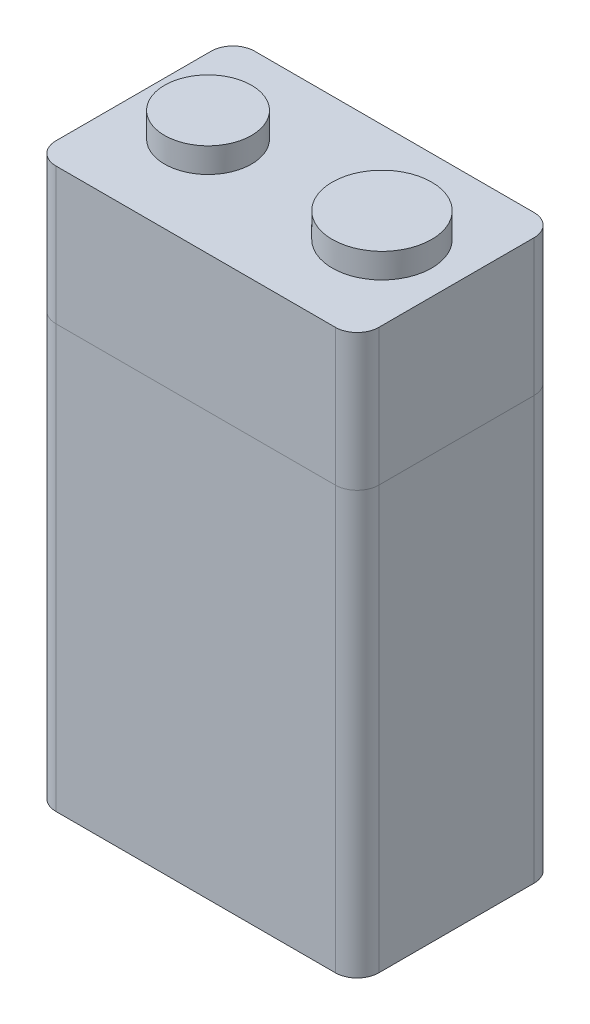
ISO-10303-21;
HEADER;
FILE_DESCRIPTION(('STEP AP214'),'2;1');
FILE_NAME('part.step','',(''),(''),'','','');
FILE_SCHEMA(('AUTOMOTIVE_DESIGN { 1 0 10303 214 1 1 1 1 }'));
ENDSEC;
DATA;
#1=APPLICATION_CONTEXT('core data for automotive mechanical design processes');
#2=APPLICATION_PROTOCOL_DEFINITION('international standard','automotive_design',2000,#1);
#3=PRODUCT_CONTEXT('',#1,'mechanical');
#4=PRODUCT('Part','Part','',(#3));
#5=PRODUCT_RELATED_PRODUCT_CATEGORY('part','',(#4));
#6=PRODUCT_DEFINITION_FORMATION('','',#4);
#7=PRODUCT_DEFINITION_CONTEXT('part definition',#1,'design');
#8=PRODUCT_DEFINITION('design','',#6,#7);
#9=PRODUCT_DEFINITION_SHAPE('','',#8);
#10=(LENGTH_UNIT() NAMED_UNIT(*) SI_UNIT(.MILLI.,.METRE.));
#11=(NAMED_UNIT(*) PLANE_ANGLE_UNIT() SI_UNIT($,.RADIAN.));
#12=(NAMED_UNIT(*) SI_UNIT($,.STERADIAN.) SOLID_ANGLE_UNIT());
#13=UNCERTAINTY_MEASURE_WITH_UNIT(LENGTH_MEASURE(1.E-05),#10,'distance_accuracy_value','');
#14=(GEOMETRIC_REPRESENTATION_CONTEXT(3) GLOBAL_UNCERTAINTY_ASSIGNED_CONTEXT((#13)) GLOBAL_UNIT_ASSIGNED_CONTEXT((#10,
#11,#12)) REPRESENTATION_CONTEXT('',''));
#15=CARTESIAN_POINT('',(0.,0.,0.));
#16=DIRECTION('',(0.,0.,1.));
#17=DIRECTION('',(1.,0.,0.));
#18=AXIS2_PLACEMENT_3D('',#15,#16,#17);
#19=CARTESIAN_POINT('',(-11.25,45.,6.25));
#20=DIRECTION('',(0.,-1.,0.));
#21=DIRECTION('',(0.,0.,-1.));
#22=AXIS2_PLACEMENT_3D('',#19,#20,#21);
#23=CYLINDRICAL_SURFACE('',#22,1.75);
#24=DIRECTION('',(0.,-1.,0.));
#25=VECTOR('',#24,1.);
#26=CARTESIAN_POINT('',(-11.25,45.,8.));
#27=LINE('',#26,#25);
#28=CARTESIAN_POINT('',(-11.25,34.,8.));
#29=VERTEX_POINT('',#28);
#30=CARTESIAN_POINT('',(-11.25,0.,8.));
#31=VERTEX_POINT('',#30);
#32=EDGE_CURVE('E206',#29,#31,#27,.T.);
#33=ORIENTED_EDGE('',*,*,#32,.F.);
#34=CARTESIAN_POINT('',(-11.25,34.,6.25));
#35=DIRECTION('',(0.,1.,0.));
#36=DIRECTION('',(0.,0.,1.));
#37=AXIS2_PLACEMENT_3D('',#34,#35,#36);
#38=CIRCLE('',#37,1.75);
#39=CARTESIAN_POINT('',(-13.,34.,6.25));
#40=VERTEX_POINT('',#39);
#41=EDGE_CURVE('E11',#29,#40,#38,.F.);
#42=ORIENTED_EDGE('',*,*,#41,.T.);
#43=DIRECTION('',(0.,-1.,0.));
#44=VECTOR('',#43,1.);
#45=CARTESIAN_POINT('',(-13.,45.,6.25));
#46=LINE('',#45,#44);
#47=CARTESIAN_POINT('',(-13.,0.,6.25));
#48=VERTEX_POINT('',#47);
#49=EDGE_CURVE('E215',#48,#40,#46,.F.);
#50=ORIENTED_EDGE('',*,*,#49,.F.);
#51=CARTESIAN_POINT('',(-11.25,0.,6.25));
#52=DIRECTION('',(0.,-1.,0.));
#53=DIRECTION('',(0.,0.,-1.));
#54=AXIS2_PLACEMENT_3D('',#51,#52,#53);
#55=CIRCLE('',#54,1.75);
#56=EDGE_CURVE('E189',#31,#48,#55,.T.);
#57=ORIENTED_EDGE('',*,*,#56,.F.);
#58=EDGE_LOOP('',(#33,#42,#50,#57));
#59=FACE_BOUND('',#58,.T.);
#60=ADVANCED_FACE('F47',(#59),#23,.T.);
#61=CARTESIAN_POINT('',(-13.,45.,8.));
#62=DIRECTION('',(1.,0.,0.));
#63=DIRECTION('',(0.,0.,-1.));
#64=AXIS2_PLACEMENT_3D('',#61,#62,#63);
#65=PLANE('',#64);
#66=DIRECTION('',(0.,0.,1.));
#67=VECTOR('',#66,1.);
#68=CARTESIAN_POINT('',(-13.,34.,8.));
#69=LINE('',#68,#67);
#70=CARTESIAN_POINT('',(-13.,34.,-6.25));
#71=VERTEX_POINT('',#70);
#72=EDGE_CURVE('E57',#71,#40,#69,.T.);
#73=ORIENTED_EDGE('',*,*,#72,.F.);
#74=DIRECTION('',(0.,-1.,0.));
#75=VECTOR('',#74,1.);
#76=CARTESIAN_POINT('',(-13.,45.,-6.25));
#77=LINE('',#76,#75);
#78=CARTESIAN_POINT('',(-13.,0.,-6.25));
#79=VERTEX_POINT('',#78);
#80=EDGE_CURVE('E217',#71,#79,#77,.T.);
#81=ORIENTED_EDGE('',*,*,#80,.T.);
#82=DIRECTION('',(0.,0.,1.));
#83=VECTOR('',#82,1.);
#84=CARTESIAN_POINT('',(-13.,0.,8.));
#85=LINE('',#84,#83);
#86=EDGE_CURVE('E167',#79,#48,#85,.T.);
#87=ORIENTED_EDGE('',*,*,#86,.T.);
#88=ORIENTED_EDGE('',*,*,#49,.T.);
#89=EDGE_LOOP('',(#73,#81,#87,#88));
#90=FACE_BOUND('',#89,.T.);
#91=ADVANCED_FACE('F293',(#90),#65,.F.);
#92=CARTESIAN_POINT('',(-11.25,45.,-6.25));
#93=DIRECTION('',(0.,-1.,0.));
#94=DIRECTION('',(0.,0.,-1.));
#95=AXIS2_PLACEMENT_3D('',#92,#93,#94);
#96=CYLINDRICAL_SURFACE('',#95,1.75);
#97=ORIENTED_EDGE('',*,*,#80,.F.);
#98=CARTESIAN_POINT('',(-11.25,34.,-6.25));
#99=DIRECTION('',(0.,1.,0.));
#100=DIRECTION('',(0.,0.,1.));
#101=AXIS2_PLACEMENT_3D('',#98,#99,#100);
#102=CIRCLE('',#101,1.75);
#103=CARTESIAN_POINT('',(-11.25,34.,-8.));
#104=VERTEX_POINT('',#103);
#105=EDGE_CURVE('E229',#71,#104,#102,.F.);
#106=ORIENTED_EDGE('',*,*,#105,.T.);
#107=DIRECTION('',(0.,-1.,0.));
#108=VECTOR('',#107,1.);
#109=CARTESIAN_POINT('',(-11.25,45.,-8.));
#110=LINE('',#109,#108);
#111=CARTESIAN_POINT('',(-11.25,0.,-8.));
#112=VERTEX_POINT('',#111);
#113=EDGE_CURVE('E150',#112,#104,#110,.F.);
#114=ORIENTED_EDGE('',*,*,#113,.F.);
#115=CARTESIAN_POINT('',(-11.25,0.,-6.25));
#116=DIRECTION('',(0.,-1.,0.));
#117=DIRECTION('',(0.,0.,-1.));
#118=AXIS2_PLACEMENT_3D('',#115,#116,#117);
#119=CIRCLE('',#118,1.75);
#120=EDGE_CURVE('E166',#79,#112,#119,.T.);
#121=ORIENTED_EDGE('',*,*,#120,.F.);
#122=EDGE_LOOP('',(#97,#106,#114,#121));
#123=FACE_BOUND('',#122,.T.);
#124=ADVANCED_FACE('F299',(#123),#96,.T.);
#125=CARTESIAN_POINT('',(-13.,45.,-8.));
#126=DIRECTION('',(0.,0.,1.));
#127=DIRECTION('',(1.,0.,0.));
#128=AXIS2_PLACEMENT_3D('',#125,#126,#127);
#129=PLANE('',#128);
#130=DIRECTION('',(-1.,0.,0.));
#131=VECTOR('',#130,1.);
#132=CARTESIAN_POINT('',(-13.,34.,-8.));
#133=LINE('',#132,#131);
#134=CARTESIAN_POINT('',(11.25,34.,-8.));
#135=VERTEX_POINT('',#134);
#136=EDGE_CURVE('E145',#135,#104,#133,.T.);
#137=ORIENTED_EDGE('',*,*,#136,.F.);
#138=DIRECTION('',(0.,-1.,0.));
#139=VECTOR('',#138,1.);
#140=CARTESIAN_POINT('',(11.25,45.,-8.));
#141=LINE('',#140,#139);
#142=CARTESIAN_POINT('',(11.25,0.,-8.));
#143=VERTEX_POINT('',#142);
#144=EDGE_CURVE('E137',#135,#143,#141,.T.);
#145=ORIENTED_EDGE('',*,*,#144,.T.);
#146=DIRECTION('',(-1.,0.,0.));
#147=VECTOR('',#146,1.);
#148=CARTESIAN_POINT('',(-13.,0.,-8.));
#149=LINE('',#148,#147);
#150=EDGE_CURVE('E142',#143,#112,#149,.T.);
#151=ORIENTED_EDGE('',*,*,#150,.T.);
#152=ORIENTED_EDGE('',*,*,#113,.T.);
#153=EDGE_LOOP('',(#137,#145,#151,#152));
#154=FACE_BOUND('',#153,.T.);
#155=ADVANCED_FACE('F139',(#154),#129,.F.);
#156=CARTESIAN_POINT('',(11.25,45.,-6.25));
#157=DIRECTION('',(0.,-1.,0.));
#158=DIRECTION('',(0.,0.,-1.));
#159=AXIS2_PLACEMENT_3D('',#156,#157,#158);
#160=CYLINDRICAL_SURFACE('',#159,1.75);
#161=ORIENTED_EDGE('',*,*,#144,.F.);
#162=CARTESIAN_POINT('',(11.25,34.,-6.25));
#163=DIRECTION('',(0.,1.,0.));
#164=DIRECTION('',(0.,0.,1.));
#165=AXIS2_PLACEMENT_3D('',#162,#163,#164);
#166=CIRCLE('',#165,1.75);
#167=CARTESIAN_POINT('',(13.,34.,-6.25));
#168=VERTEX_POINT('',#167);
#169=EDGE_CURVE('E225',#135,#168,#166,.F.);
#170=ORIENTED_EDGE('',*,*,#169,.T.);
#171=DIRECTION('',(0.,-1.,0.));
#172=VECTOR('',#171,1.);
#173=CARTESIAN_POINT('',(13.,45.,-6.25));
#174=LINE('',#173,#172);
#175=CARTESIAN_POINT('',(13.,0.,-6.25));
#176=VERTEX_POINT('',#175);
#177=EDGE_CURVE('E156',#176,#168,#174,.F.);
#178=ORIENTED_EDGE('',*,*,#177,.F.);
#179=CARTESIAN_POINT('',(11.25,0.,-6.25));
#180=DIRECTION('',(0.,-1.,0.));
#181=DIRECTION('',(0.,0.,-1.));
#182=AXIS2_PLACEMENT_3D('',#179,#180,#181);
#183=CIRCLE('',#182,1.75);
#184=EDGE_CURVE('E153',#143,#176,#183,.T.);
#185=ORIENTED_EDGE('',*,*,#184,.F.);
#186=EDGE_LOOP('',(#161,#170,#178,#185));
#187=FACE_BOUND('',#186,.T.);
#188=ADVANCED_FACE('F154',(#187),#160,.T.);
#189=CARTESIAN_POINT('',(13.,45.,8.));
#190=DIRECTION('',(-1.,0.,0.));
#191=DIRECTION('',(0.,0.,1.));
#192=AXIS2_PLACEMENT_3D('',#189,#190,#191);
#193=PLANE('',#192);
#194=DIRECTION('',(0.,0.,-1.));
#195=VECTOR('',#194,1.);
#196=CARTESIAN_POINT('',(13.,34.,8.));
#197=LINE('',#196,#195);
#198=CARTESIAN_POINT('',(13.,34.,6.25));
#199=VERTEX_POINT('',#198);
#200=EDGE_CURVE('E221',#199,#168,#197,.T.);
#201=ORIENTED_EDGE('',*,*,#200,.F.);
#202=DIRECTION('',(0.,-1.,0.));
#203=VECTOR('',#202,1.);
#204=CARTESIAN_POINT('',(13.,45.,6.25));
#205=LINE('',#204,#203);
#206=CARTESIAN_POINT('',(13.,0.,6.25));
#207=VERTEX_POINT('',#206);
#208=EDGE_CURVE('E160',#199,#207,#205,.T.);
#209=ORIENTED_EDGE('',*,*,#208,.T.);
#210=DIRECTION('',(0.,0.,-1.));
#211=VECTOR('',#210,1.);
#212=CARTESIAN_POINT('',(13.,0.,8.));
#213=LINE('',#212,#211);
#214=EDGE_CURVE('E168',#207,#176,#213,.T.);
#215=ORIENTED_EDGE('',*,*,#214,.T.);
#216=ORIENTED_EDGE('',*,*,#177,.T.);
#217=EDGE_LOOP('',(#201,#209,#215,#216));
#218=FACE_BOUND('',#217,.T.);
#219=ADVANCED_FACE('F263',(#218),#193,.F.);
#220=CARTESIAN_POINT('',(11.25,45.,6.25));
#221=DIRECTION('',(0.,-1.,0.));
#222=DIRECTION('',(0.,0.,-1.));
#223=AXIS2_PLACEMENT_3D('',#220,#221,#222);
#224=CYLINDRICAL_SURFACE('',#223,1.75);
#225=ORIENTED_EDGE('',*,*,#208,.F.);
#226=CARTESIAN_POINT('',(11.25,34.,6.25));
#227=DIRECTION('',(0.,1.,0.));
#228=DIRECTION('',(0.,0.,1.));
#229=AXIS2_PLACEMENT_3D('',#226,#227,#228);
#230=CIRCLE('',#229,1.75);
#231=CARTESIAN_POINT('',(11.25,34.,8.));
#232=VERTEX_POINT('',#231);
#233=EDGE_CURVE('E226',#199,#232,#230,.F.);
#234=ORIENTED_EDGE('',*,*,#233,.T.);
#235=DIRECTION('',(0.,-1.,0.));
#236=VECTOR('',#235,1.);
#237=CARTESIAN_POINT('',(11.25,45.,8.));
#238=LINE('',#237,#236);
#239=CARTESIAN_POINT('',(11.25,0.,8.));
#240=VERTEX_POINT('',#239);
#241=EDGE_CURVE('E211',#240,#232,#238,.F.);
#242=ORIENTED_EDGE('',*,*,#241,.F.);
#243=CARTESIAN_POINT('',(11.25,0.,6.25));
#244=DIRECTION('',(0.,-1.,0.));
#245=DIRECTION('',(0.,0.,-1.));
#246=AXIS2_PLACEMENT_3D('',#243,#244,#245);
#247=CIRCLE('',#246,1.75);
#248=EDGE_CURVE('E161',#207,#240,#247,.T.);
#249=ORIENTED_EDGE('',*,*,#248,.F.);
#250=EDGE_LOOP('',(#225,#234,#242,#249));
#251=FACE_BOUND('',#250,.T.);
#252=ADVANCED_FACE('F261',(#251),#224,.T.);
#253=CARTESIAN_POINT('',(-13.,45.,8.));
#254=DIRECTION('',(0.,0.,-1.));
#255=DIRECTION('',(-1.,0.,0.));
#256=AXIS2_PLACEMENT_3D('',#253,#254,#255);
#257=PLANE('',#256);
#258=DIRECTION('',(1.,0.,0.));
#259=VECTOR('',#258,1.);
#260=CARTESIAN_POINT('',(-13.,34.,8.));
#261=LINE('',#260,#259);
#262=EDGE_CURVE('E51',#29,#232,#261,.T.);
#263=ORIENTED_EDGE('',*,*,#262,.F.);
#264=ORIENTED_EDGE('',*,*,#32,.T.);
#265=DIRECTION('',(1.,0.,0.));
#266=VECTOR('',#265,1.);
#267=CARTESIAN_POINT('',(-13.,0.,8.));
#268=LINE('',#267,#266);
#269=EDGE_CURVE('E171',#31,#240,#268,.T.);
#270=ORIENTED_EDGE('',*,*,#269,.T.);
#271=ORIENTED_EDGE('',*,*,#241,.T.);
#272=EDGE_LOOP('',(#263,#264,#270,#271));
#273=FACE_BOUND('',#272,.T.);
#274=ADVANCED_FACE('F258',(#273),#257,.F.);
#275=CARTESIAN_POINT('',(13.,45.,6.25));
#276=VERTEX_POINT('',#275);
#277=EDGE_CURVE('E193',#276,#199,#205,.T.);
#278=ORIENTED_EDGE('',*,*,#277,.T.);
#279=ORIENTED_EDGE('',*,*,#200,.T.);
#280=CARTESIAN_POINT('',(13.,45.,-6.25));
#281=VERTEX_POINT('',#280);
#282=EDGE_CURVE('E196',#168,#281,#174,.F.);
#283=ORIENTED_EDGE('',*,*,#282,.T.);
#284=DIRECTION('',(0.,0.,-1.));
#285=VECTOR('',#284,1.);
#286=CARTESIAN_POINT('',(13.,45.,8.));
#287=LINE('',#286,#285);
#288=EDGE_CURVE('E179',#276,#281,#287,.T.);
#289=ORIENTED_EDGE('',*,*,#288,.F.);
#290=EDGE_LOOP('',(#278,#279,#283,#289));
#291=FACE_BOUND('',#290,.T.);
#292=ADVANCED_FACE('F266',(#291),#193,.F.);
#293=CARTESIAN_POINT('',(11.25,45.,-8.));
#294=VERTEX_POINT('',#293);
#295=EDGE_CURVE('E149',#294,#135,#141,.T.);
#296=ORIENTED_EDGE('',*,*,#295,.T.);
#297=ORIENTED_EDGE('',*,*,#136,.T.);
#298=CARTESIAN_POINT('',(-11.25,45.,-8.));
#299=VERTEX_POINT('',#298);
#300=EDGE_CURVE('E187',#104,#299,#110,.F.);
#301=ORIENTED_EDGE('',*,*,#300,.T.);
#302=DIRECTION('',(-1.,0.,0.));
#303=VECTOR('',#302,1.);
#304=CARTESIAN_POINT('',(-13.,45.,-8.));
#305=LINE('',#304,#303);
#306=EDGE_CURVE('E277',#294,#299,#305,.T.);
#307=ORIENTED_EDGE('',*,*,#306,.F.);
#308=EDGE_LOOP('',(#296,#297,#301,#307));
#309=FACE_BOUND('',#308,.T.);
#310=ADVANCED_FACE('F280',(#309),#129,.F.);
#311=CARTESIAN_POINT('',(-13.,45.,-6.25));
#312=VERTEX_POINT('',#311);
#313=EDGE_CURVE('E218',#312,#71,#77,.T.);
#314=ORIENTED_EDGE('',*,*,#313,.T.);
#315=ORIENTED_EDGE('',*,*,#72,.T.);
#316=CARTESIAN_POINT('',(-13.,45.,6.25));
#317=VERTEX_POINT('',#316);
#318=EDGE_CURVE('E214',#40,#317,#46,.F.);
#319=ORIENTED_EDGE('',*,*,#318,.T.);
#320=DIRECTION('',(0.,0.,1.));
#321=VECTOR('',#320,1.);
#322=CARTESIAN_POINT('',(-13.,45.,8.));
#323=LINE('',#322,#321);
#324=EDGE_CURVE('E282',#312,#317,#323,.T.);
#325=ORIENTED_EDGE('',*,*,#324,.F.);
#326=EDGE_LOOP('',(#314,#315,#319,#325));
#327=FACE_BOUND('',#326,.T.);
#328=ADVANCED_FACE('F301',(#327),#65,.F.);
#329=CARTESIAN_POINT('',(-11.25,45.,8.));
#330=VERTEX_POINT('',#329);
#331=EDGE_CURVE('E207',#330,#29,#27,.T.);
#332=ORIENTED_EDGE('',*,*,#331,.T.);
#333=ORIENTED_EDGE('',*,*,#262,.T.);
#334=CARTESIAN_POINT('',(11.25,45.,8.));
#335=VERTEX_POINT('',#334);
#336=EDGE_CURVE('E210',#232,#335,#238,.F.);
#337=ORIENTED_EDGE('',*,*,#336,.T.);
#338=DIRECTION('',(1.,0.,0.));
#339=VECTOR('',#338,1.);
#340=CARTESIAN_POINT('',(-13.,45.,8.));
#341=LINE('',#340,#339);
#342=EDGE_CURVE('E184',#330,#335,#341,.T.);
#343=ORIENTED_EDGE('',*,*,#342,.F.);
#344=EDGE_LOOP('',(#332,#333,#337,#343));
#345=FACE_BOUND('',#344,.T.);
#346=ADVANCED_FACE('F249',(#345),#257,.F.);
#347=CARTESIAN_POINT('',(0.,45.,0.));
#348=DIRECTION('',(0.,-1.,0.));
#349=DIRECTION('',(0.,0.,-1.));
#350=AXIS2_PLACEMENT_3D('',#347,#348,#349);
#351=PLANE('',#350);
#352=CARTESIAN_POINT('',(7.,45.,0.));
#353=DIRECTION('',(0.,-1.,0.));
#354=DIRECTION('',(0.,0.,-1.));
#355=AXIS2_PLACEMENT_3D('',#352,#353,#354);
#356=CIRCLE('',#355,4.);
#357=CARTESIAN_POINT('',(7.,45.,-4.));
#358=VERTEX_POINT('',#357);
#359=EDGE_CURVE('E183',#358,#358,#356,.F.);
#360=ORIENTED_EDGE('',*,*,#359,.F.);
#361=EDGE_LOOP('',(#360));
#362=FACE_BOUND('',#361,.T.);
#363=CARTESIAN_POINT('',(-7.,45.,0.));
#364=DIRECTION('',(0.,-1.,0.));
#365=DIRECTION('',(0.,0.,-1.));
#366=AXIS2_PLACEMENT_3D('',#363,#364,#365);
#367=CIRCLE('',#366,3.5);
#368=CARTESIAN_POINT('',(-7.,45.,-3.5));
#369=VERTEX_POINT('',#368);
#370=EDGE_CURVE('E180',#369,#369,#367,.F.);
#371=ORIENTED_EDGE('',*,*,#370,.F.);
#372=EDGE_LOOP('',(#371));
#373=FACE_BOUND('',#372,.T.);
#374=ORIENTED_EDGE('',*,*,#288,.T.);
#375=CARTESIAN_POINT('',(11.25,45.,-6.25));
#376=DIRECTION('',(0.,-1.,0.));
#377=DIRECTION('',(0.,0.,-1.));
#378=AXIS2_PLACEMENT_3D('',#375,#376,#377);
#379=CIRCLE('',#378,1.75);
#380=EDGE_CURVE('E204',#281,#294,#379,.F.);
#381=ORIENTED_EDGE('',*,*,#380,.T.);
#382=ORIENTED_EDGE('',*,*,#306,.T.);
#383=CARTESIAN_POINT('',(-11.25,45.,-6.25));
#384=DIRECTION('',(0.,-1.,0.));
#385=DIRECTION('',(0.,0.,-1.));
#386=AXIS2_PLACEMENT_3D('',#383,#384,#385);
#387=CIRCLE('',#386,1.75);
#388=EDGE_CURVE('E200',#299,#312,#387,.F.);
#389=ORIENTED_EDGE('',*,*,#388,.T.);
#390=ORIENTED_EDGE('',*,*,#324,.T.);
#391=CARTESIAN_POINT('',(-11.25,45.,6.25));
#392=DIRECTION('',(0.,-1.,0.));
#393=DIRECTION('',(0.,0.,-1.));
#394=AXIS2_PLACEMENT_3D('',#391,#392,#393);
#395=CIRCLE('',#394,1.75);
#396=EDGE_CURVE('E198',#317,#330,#395,.F.);
#397=ORIENTED_EDGE('',*,*,#396,.T.);
#398=ORIENTED_EDGE('',*,*,#342,.T.);
#399=CARTESIAN_POINT('',(11.25,45.,6.25));
#400=DIRECTION('',(0.,-1.,0.));
#401=DIRECTION('',(0.,0.,-1.));
#402=AXIS2_PLACEMENT_3D('',#399,#400,#401);
#403=CIRCLE('',#402,1.75);
#404=EDGE_CURVE('E202',#335,#276,#403,.F.);
#405=ORIENTED_EDGE('',*,*,#404,.T.);
#406=EDGE_LOOP('',(#374,#381,#382,#389,#390,#397,#398,#405));
#407=FACE_BOUND('',#406,.T.);
#408=ADVANCED_FACE('F276',(#362,#373,#407),#351,.F.);
#409=CARTESIAN_POINT('',(0.,0.,0.));
#410=DIRECTION('',(0.,-1.,0.));
#411=DIRECTION('',(0.,0.,-1.));
#412=AXIS2_PLACEMENT_3D('',#409,#410,#411);
#413=PLANE('',#412);
#414=ORIENTED_EDGE('',*,*,#150,.F.);
#415=ORIENTED_EDGE('',*,*,#184,.T.);
#416=ORIENTED_EDGE('',*,*,#214,.F.);
#417=ORIENTED_EDGE('',*,*,#248,.T.);
#418=ORIENTED_EDGE('',*,*,#269,.F.);
#419=ORIENTED_EDGE('',*,*,#56,.T.);
#420=ORIENTED_EDGE('',*,*,#86,.F.);
#421=ORIENTED_EDGE('',*,*,#120,.T.);
#422=EDGE_LOOP('',(#414,#415,#416,#417,#418,#419,#420,#421));
#423=FACE_BOUND('',#422,.T.);
#424=ADVANCED_FACE('F163',(#423),#413,.T.);
#425=CARTESIAN_POINT('',(-7.,47.,0.));
#426=DIRECTION('',(0.,-1.,0.));
#427=DIRECTION('',(0.,0.,-1.));
#428=AXIS2_PLACEMENT_3D('',#425,#426,#427);
#429=CYLINDRICAL_SURFACE('',#428,3.5);
#430=CARTESIAN_POINT('',(-7.,47.,0.));
#431=DIRECTION('',(0.,1.,0.));
#432=DIRECTION('',(0.,0.,1.));
#433=AXIS2_PLACEMENT_3D('',#430,#431,#432);
#434=CIRCLE('',#433,3.5);
#435=CARTESIAN_POINT('',(-7.,47.,3.5));
#436=VERTEX_POINT('',#435);
#437=EDGE_CURVE('E173',#436,#436,#434,.T.);
#438=ORIENTED_EDGE('',*,*,#437,.F.);
#439=EDGE_LOOP('',(#438));
#440=FACE_BOUND('',#439,.T.);
#441=ORIENTED_EDGE('',*,*,#370,.T.);
#442=EDGE_LOOP('',(#441));
#443=FACE_BOUND('',#442,.T.);
#444=ADVANCED_FACE('F384',(#440,#443),#429,.T.);
#445=CARTESIAN_POINT('',(-7.,47.,0.));
#446=DIRECTION('',(0.,1.,0.));
#447=DIRECTION('',(0.,0.,1.));
#448=AXIS2_PLACEMENT_3D('',#445,#446,#447);
#449=PLANE('',#448);
#450=ORIENTED_EDGE('',*,*,#437,.T.);
#451=EDGE_LOOP('',(#450));
#452=FACE_BOUND('',#451,.T.);
#453=ADVANCED_FACE('F388',(#452),#449,.T.);
#454=CARTESIAN_POINT('',(7.,47.,0.));
#455=DIRECTION('',(0.,-1.,0.));
#456=DIRECTION('',(0.,0.,-1.));
#457=AXIS2_PLACEMENT_3D('',#454,#455,#456);
#458=CYLINDRICAL_SURFACE('',#457,4.);
#459=CARTESIAN_POINT('',(7.,47.,0.));
#460=DIRECTION('',(0.,1.,0.));
#461=DIRECTION('',(0.,0.,1.));
#462=AXIS2_PLACEMENT_3D('',#459,#460,#461);
#463=CIRCLE('',#462,4.);
#464=CARTESIAN_POINT('',(7.,47.,4.));
#465=VERTEX_POINT('',#464);
#466=EDGE_CURVE('E638',#465,#465,#463,.T.);
#467=ORIENTED_EDGE('',*,*,#466,.F.);
#468=EDGE_LOOP('',(#467));
#469=FACE_BOUND('',#468,.T.);
#470=ORIENTED_EDGE('',*,*,#359,.T.);
#471=EDGE_LOOP('',(#470));
#472=FACE_BOUND('',#471,.T.);
#473=ADVANCED_FACE('F335',(#469,#472),#458,.T.);
#474=CARTESIAN_POINT('',(7.,47.,0.));
#475=DIRECTION('',(0.,1.,0.));
#476=DIRECTION('',(0.,0.,1.));
#477=AXIS2_PLACEMENT_3D('',#474,#475,#476);
#478=PLANE('',#477);
#479=ORIENTED_EDGE('',*,*,#466,.T.);
#480=EDGE_LOOP('',(#479));
#481=FACE_BOUND('',#480,.T.);
#482=ADVANCED_FACE('F331',(#481),#478,.T.);
#483=ORIENTED_EDGE('',*,*,#169,.F.);
#484=ORIENTED_EDGE('',*,*,#295,.F.);
#485=ORIENTED_EDGE('',*,*,#380,.F.);
#486=ORIENTED_EDGE('',*,*,#282,.F.);
#487=EDGE_LOOP('',(#483,#484,#485,#486));
#488=FACE_BOUND('',#487,.T.);
#489=ADVANCED_FACE('F271',(#488),#160,.T.);
#490=ORIENTED_EDGE('',*,*,#233,.F.);
#491=ORIENTED_EDGE('',*,*,#277,.F.);
#492=ORIENTED_EDGE('',*,*,#404,.F.);
#493=ORIENTED_EDGE('',*,*,#336,.F.);
#494=EDGE_LOOP('',(#490,#491,#492,#493));
#495=FACE_BOUND('',#494,.T.);
#496=ADVANCED_FACE('F256',(#495),#224,.T.);
#497=ORIENTED_EDGE('',*,*,#105,.F.);
#498=ORIENTED_EDGE('',*,*,#313,.F.);
#499=ORIENTED_EDGE('',*,*,#388,.F.);
#500=ORIENTED_EDGE('',*,*,#300,.F.);
#501=EDGE_LOOP('',(#497,#498,#499,#500));
#502=FACE_BOUND('',#501,.T.);
#503=ADVANCED_FACE('F303',(#502),#96,.T.);
#504=ORIENTED_EDGE('',*,*,#41,.F.);
#505=ORIENTED_EDGE('',*,*,#331,.F.);
#506=ORIENTED_EDGE('',*,*,#396,.F.);
#507=ORIENTED_EDGE('',*,*,#318,.F.);
#508=EDGE_LOOP('',(#504,#505,#506,#507));
#509=FACE_BOUND('',#508,.T.);
#510=ADVANCED_FACE('F49',(#509),#23,.T.);
#511=CLOSED_SHELL('',(#60,#91,#124,#155,#188,#219,#252,#274,#292,#310,#328,#346,#408,#424,#444,
#453,#473,#482,#489,#496,#503,#510));
#512=MANIFOLD_SOLID_BREP('B2',#511);
#513=ADVANCED_BREP_SHAPE_REPRESENTATION('',(#18,#512),#14);
#514=SHAPE_DEFINITION_REPRESENTATION(#9,#513);
ENDSEC;
END-ISO-10303-21;
